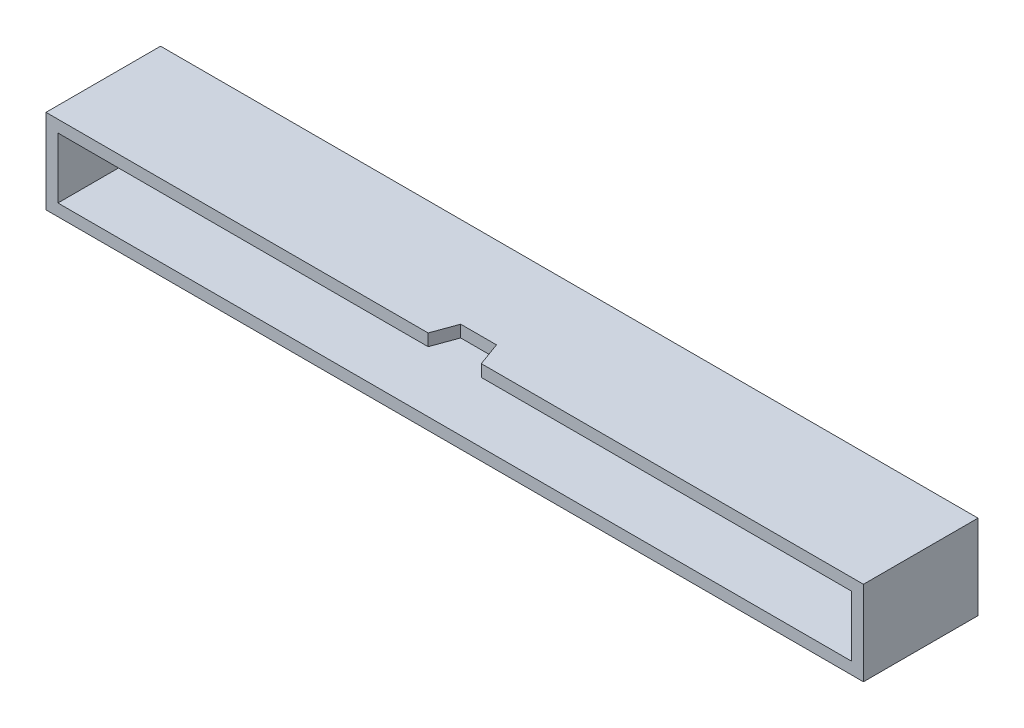
ISO-10303-21;
HEADER;
FILE_DESCRIPTION(('STEP AP214'),'2;1');
FILE_NAME('part.step','',(''),(''),'','','');
FILE_SCHEMA(('AUTOMOTIVE_DESIGN { 1 0 10303 214 1 1 1 1 }'));
ENDSEC;
DATA;
#1=APPLICATION_CONTEXT('core data for automotive mechanical design processes');
#2=APPLICATION_PROTOCOL_DEFINITION('international standard','automotive_design',2000,#1);
#3=PRODUCT_CONTEXT('',#1,'mechanical');
#4=PRODUCT('Part','Part','',(#3));
#5=PRODUCT_RELATED_PRODUCT_CATEGORY('part','',(#4));
#6=PRODUCT_DEFINITION_FORMATION('','',#4);
#7=PRODUCT_DEFINITION_CONTEXT('part definition',#1,'design');
#8=PRODUCT_DEFINITION('design','',#6,#7);
#9=PRODUCT_DEFINITION_SHAPE('','',#8);
#10=(LENGTH_UNIT() NAMED_UNIT(*) SI_UNIT(.MILLI.,.METRE.));
#11=(NAMED_UNIT(*) PLANE_ANGLE_UNIT() SI_UNIT($,.RADIAN.));
#12=(NAMED_UNIT(*) SI_UNIT($,.STERADIAN.) SOLID_ANGLE_UNIT());
#13=UNCERTAINTY_MEASURE_WITH_UNIT(LENGTH_MEASURE(1.E-05),#10,'distance_accuracy_value','');
#14=(GEOMETRIC_REPRESENTATION_CONTEXT(3) GLOBAL_UNCERTAINTY_ASSIGNED_CONTEXT((#13)) GLOBAL_UNIT_ASSIGNED_CONTEXT((#10,
#11,#12)) REPRESENTATION_CONTEXT('',''));
#15=CARTESIAN_POINT('',(0.,0.,0.));
#16=DIRECTION('',(0.,0.,1.));
#17=DIRECTION('',(1.,0.,0.));
#18=AXIS2_PLACEMENT_3D('',#15,#16,#17);
#19=CARTESIAN_POINT('',(33.48,3.54,7.60000000000002));
#20=DIRECTION('',(0.939692620785973,0.,-0.34202014332549));
#21=DIRECTION('',(-0.34202014332549,0.,-0.939692620785973));
#22=AXIS2_PLACEMENT_3D('',#19,#20,#21);
#23=PLANE('',#22);
#24=DIRECTION('',(0.,1.,0.));
#25=VECTOR('',#24,1.);
#26=CARTESIAN_POINT('',(34.207940468532,3.54,9.60000000000001));
#27=LINE('',#26,#25);
#28=CARTESIAN_POINT('',(34.207940468532,3.54,9.6));
#29=VERTEX_POINT('',#28);
#30=CARTESIAN_POINT('',(34.207940468532,2.53999998509884,9.60000000000001));
#31=VERTEX_POINT('',#30);
#32=EDGE_CURVE('E20',#29,#31,#27,.F.);
#33=ORIENTED_EDGE('',*,*,#32,.F.);
#34=DIRECTION('',(0.342020143325507,0.,0.939692620785967));
#35=VECTOR('',#34,1.);
#36=CARTESIAN_POINT('',(33.48,3.54,7.60000000000002));
#37=LINE('',#36,#35);
#38=CARTESIAN_POINT('',(33.48,3.54,7.60000000000002));
#39=VERTEX_POINT('',#38);
#40=EDGE_CURVE('E114',#39,#29,#37,.T.);
#41=ORIENTED_EDGE('',*,*,#40,.F.);
#42=DIRECTION('',(0.,1.,0.));
#43=VECTOR('',#42,1.);
#44=CARTESIAN_POINT('',(33.48,3.54,7.60000000000001));
#45=LINE('',#44,#43);
#46=CARTESIAN_POINT('',(33.48,2.53999998509884,7.60000000000002));
#47=VERTEX_POINT('',#46);
#48=EDGE_CURVE('E109',#39,#47,#45,.F.);
#49=ORIENTED_EDGE('',*,*,#48,.T.);
#50=DIRECTION('',(-0.342020143325507,0.,-0.939692620785967));
#51=VECTOR('',#50,1.);
#52=CARTESIAN_POINT('',(34.207940468532,2.53999998509884,9.6));
#53=LINE('',#52,#51);
#54=EDGE_CURVE('E111',#31,#47,#53,.T.);
#55=ORIENTED_EDGE('',*,*,#54,.F.);
#56=EDGE_LOOP('',(#33,#41,#49,#55));
#57=FACE_BOUND('',#56,.T.);
#58=ADVANCED_FACE('F17',(#57),#23,.F.);
#59=CARTESIAN_POINT('',(29.7520595314676,3.54,9.6));
#60=DIRECTION('',(-0.939692620785908,0.,-0.342020143325669));
#61=DIRECTION('',(-0.342020143325669,0.,0.939692620785908));
#62=AXIS2_PLACEMENT_3D('',#59,#60,#61);
#63=PLANE('',#62);
#64=DIRECTION('',(0.,1.,0.));
#65=VECTOR('',#64,1.);
#66=CARTESIAN_POINT('',(30.48,3.54,7.60000000000001));
#67=LINE('',#66,#65);
#68=CARTESIAN_POINT('',(30.48,2.53999998509884,7.60000000000001));
#69=VERTEX_POINT('',#68);
#70=CARTESIAN_POINT('',(30.48,3.54,7.60000000000001));
#71=VERTEX_POINT('',#70);
#72=EDGE_CURVE('E103',#69,#71,#67,.T.);
#73=ORIENTED_EDGE('',*,*,#72,.T.);
#74=DIRECTION('',(0.342020143325667,0.,-0.939692620785909));
#75=VECTOR('',#74,1.);
#76=CARTESIAN_POINT('',(29.7520595314676,3.54,9.6));
#77=LINE('',#76,#75);
#78=CARTESIAN_POINT('',(29.7520595314676,3.54,9.6));
#79=VERTEX_POINT('',#78);
#80=EDGE_CURVE('E150',#79,#71,#77,.T.);
#81=ORIENTED_EDGE('',*,*,#80,.F.);
#82=DIRECTION('',(0.,1.,0.));
#83=VECTOR('',#82,1.);
#84=CARTESIAN_POINT('',(29.7520595314676,3.54,9.6));
#85=LINE('',#84,#83);
#86=CARTESIAN_POINT('',(29.7520595314676,2.53999998509884,9.6));
#87=VERTEX_POINT('',#86);
#88=EDGE_CURVE('E136',#87,#79,#85,.T.);
#89=ORIENTED_EDGE('',*,*,#88,.F.);
#90=DIRECTION('',(-0.342020143325666,0.,0.93969262078591));
#91=VECTOR('',#90,1.);
#92=CARTESIAN_POINT('',(30.48,2.53999998509884,7.60000000000001));
#93=LINE('',#92,#91);
#94=EDGE_CURVE('E123',#69,#87,#93,.T.);
#95=ORIENTED_EDGE('',*,*,#94,.F.);
#96=EDGE_LOOP('',(#73,#81,#89,#95));
#97=FACE_BOUND('',#96,.T.);
#98=ADVANCED_FACE('F253',(#97),#63,.F.);
#99=CARTESIAN_POINT('',(30.48,3.54,7.60000000000001));
#100=DIRECTION('',(0.,0.,-1.));
#101=DIRECTION('',(-1.,0.,0.));
#102=AXIS2_PLACEMENT_3D('',#99,#100,#101);
#103=PLANE('',#102);
#104=ORIENTED_EDGE('',*,*,#48,.F.);
#105=DIRECTION('',(1.,0.,0.));
#106=VECTOR('',#105,1.);
#107=CARTESIAN_POINT('',(66.23,3.54,7.60000000000001));
#108=LINE('',#107,#106);
#109=EDGE_CURVE('E149',#71,#39,#108,.T.);
#110=ORIENTED_EDGE('',*,*,#109,.F.);
#111=ORIENTED_EDGE('',*,*,#72,.F.);
#112=DIRECTION('',(1.,0.,0.));
#113=VECTOR('',#112,1.);
#114=CARTESIAN_POINT('',(-1.26999998509884,2.53999998509884,7.60000000000002));
#115=LINE('',#114,#113);
#116=EDGE_CURVE('E119',#47,#69,#115,.F.);
#117=ORIENTED_EDGE('',*,*,#116,.F.);
#118=EDGE_LOOP('',(#104,#110,#111,#117));
#119=FACE_BOUND('',#118,.T.);
#120=ADVANCED_FACE('F120',(#119),#103,.F.);
#121=CARTESIAN_POINT('',(65.2299999850988,2.53999998509884,0.));
#122=DIRECTION('',(-1.,0.,0.));
#123=DIRECTION('',(0.,0.,1.));
#124=AXIS2_PLACEMENT_3D('',#121,#122,#123);
#125=PLANE('',#124);
#126=DIRECTION('',(0.,1.,0.));
#127=VECTOR('',#126,1.);
#128=CARTESIAN_POINT('',(65.2299999850988,0.,9.6));
#129=LINE('',#128,#127);
#130=CARTESIAN_POINT('',(65.2299999850988,2.53999998509884,9.6));
#131=VERTEX_POINT('',#130);
#132=CARTESIAN_POINT('',(65.2299999850988,-2.53999998509884,9.6));
#133=VERTEX_POINT('',#132);
#134=EDGE_CURVE('E175',#131,#133,#129,.F.);
#135=ORIENTED_EDGE('',*,*,#134,.F.);
#136=DIRECTION('',(0.,0.,-1.));
#137=VECTOR('',#136,1.);
#138=CARTESIAN_POINT('',(65.2299999850988,2.53999998509884,0.));
#139=LINE('',#138,#137);
#140=CARTESIAN_POINT('',(65.2299999850988,2.53999998509884,0.));
#141=VERTEX_POINT('',#140);
#142=EDGE_CURVE('E151',#141,#131,#139,.F.);
#143=ORIENTED_EDGE('',*,*,#142,.F.);
#144=DIRECTION('',(0.,1.,0.));
#145=VECTOR('',#144,1.);
#146=CARTESIAN_POINT('',(65.2299999850988,0.,0.));
#147=LINE('',#146,#145);
#148=CARTESIAN_POINT('',(65.2299999850988,-2.53999998509884,0.));
#149=VERTEX_POINT('',#148);
#150=EDGE_CURVE('E190',#141,#149,#147,.F.);
#151=ORIENTED_EDGE('',*,*,#150,.T.);
#152=DIRECTION('',(0.,0.,1.));
#153=VECTOR('',#152,1.);
#154=CARTESIAN_POINT('',(65.2299999850988,-2.53999998509884,0.));
#155=LINE('',#154,#153);
#156=EDGE_CURVE('E116',#133,#149,#155,.F.);
#157=ORIENTED_EDGE('',*,*,#156,.F.);
#158=EDGE_LOOP('',(#135,#143,#151,#157));
#159=FACE_BOUND('',#158,.T.);
#160=ADVANCED_FACE('F247',(#159),#125,.T.);
#161=CARTESIAN_POINT('',(65.2299999850988,-2.53999998509884,0.));
#162=DIRECTION('',(0.,1.,0.));
#163=DIRECTION('',(0.,0.,1.));
#164=AXIS2_PLACEMENT_3D('',#161,#162,#163);
#165=PLANE('',#164);
#166=DIRECTION('',(1.,0.,0.));
#167=VECTOR('',#166,1.);
#168=CARTESIAN_POINT('',(31.98,-2.53999998509884,9.6));
#169=LINE('',#168,#167);
#170=CARTESIAN_POINT('',(-1.26999998509884,-2.53999998509884,9.6));
#171=VERTEX_POINT('',#170);
#172=EDGE_CURVE('E170',#133,#171,#169,.F.);
#173=ORIENTED_EDGE('',*,*,#172,.F.);
#174=ORIENTED_EDGE('',*,*,#156,.T.);
#175=DIRECTION('',(1.,0.,0.));
#176=VECTOR('',#175,1.);
#177=CARTESIAN_POINT('',(31.98,-2.53999998509884,0.));
#178=LINE('',#177,#176);
#179=CARTESIAN_POINT('',(-1.26999998509884,-2.53999998509884,0.));
#180=VERTEX_POINT('',#179);
#181=EDGE_CURVE('E188',#149,#180,#178,.F.);
#182=ORIENTED_EDGE('',*,*,#181,.T.);
#183=DIRECTION('',(0.,0.,1.));
#184=VECTOR('',#183,1.);
#185=CARTESIAN_POINT('',(-1.26999998509884,-2.53999998509884,0.));
#186=LINE('',#185,#184);
#187=EDGE_CURVE('E128',#171,#180,#186,.F.);
#188=ORIENTED_EDGE('',*,*,#187,.F.);
#189=EDGE_LOOP('',(#173,#174,#182,#188));
#190=FACE_BOUND('',#189,.T.);
#191=ADVANCED_FACE('F243',(#190),#165,.T.);
#192=CARTESIAN_POINT('',(-1.26999998509884,-2.53999998509884,0.));
#193=DIRECTION('',(1.,0.,0.));
#194=DIRECTION('',(0.,1.,0.));
#195=AXIS2_PLACEMENT_3D('',#192,#193,#194);
#196=PLANE('',#195);
#197=DIRECTION('',(0.,1.,0.));
#198=VECTOR('',#197,1.);
#199=CARTESIAN_POINT('',(-1.26999998509884,0.,9.6));
#200=LINE('',#199,#198);
#201=CARTESIAN_POINT('',(-1.26999998509884,2.53999998509884,9.6));
#202=VERTEX_POINT('',#201);
#203=EDGE_CURVE('E165',#171,#202,#200,.T.);
#204=ORIENTED_EDGE('',*,*,#203,.F.);
#205=ORIENTED_EDGE('',*,*,#187,.T.);
#206=DIRECTION('',(0.,1.,0.));
#207=VECTOR('',#206,1.);
#208=CARTESIAN_POINT('',(-1.26999998509884,0.,0.));
#209=LINE('',#208,#207);
#210=CARTESIAN_POINT('',(-1.26999998509884,2.53999998509884,0.));
#211=VERTEX_POINT('',#210);
#212=EDGE_CURVE('E186',#180,#211,#209,.T.);
#213=ORIENTED_EDGE('',*,*,#212,.T.);
#214=DIRECTION('',(0.,0.,-1.));
#215=VECTOR('',#214,1.);
#216=CARTESIAN_POINT('',(-1.26999998509884,2.53999998509884,0.));
#217=LINE('',#216,#215);
#218=EDGE_CURVE('E154',#202,#211,#217,.T.);
#219=ORIENTED_EDGE('',*,*,#218,.F.);
#220=EDGE_LOOP('',(#204,#205,#213,#219));
#221=FACE_BOUND('',#220,.T.);
#222=ADVANCED_FACE('F240',(#221),#196,.T.);
#223=CARTESIAN_POINT('',(-1.26999998509884,2.53999998509884,0.));
#224=DIRECTION('',(0.,-1.,0.));
#225=DIRECTION('',(0.,0.,-1.));
#226=AXIS2_PLACEMENT_3D('',#223,#224,#225);
#227=PLANE('',#226);
#228=ORIENTED_EDGE('',*,*,#142,.T.);
#229=DIRECTION('',(1.,0.,0.));
#230=VECTOR('',#229,1.);
#231=CARTESIAN_POINT('',(31.98,2.53999998509884,9.6));
#232=LINE('',#231,#230);
#233=EDGE_CURVE('E127',#31,#131,#232,.T.);
#234=ORIENTED_EDGE('',*,*,#233,.F.);
#235=ORIENTED_EDGE('',*,*,#54,.T.);
#236=ORIENTED_EDGE('',*,*,#116,.T.);
#237=ORIENTED_EDGE('',*,*,#94,.T.);
#238=DIRECTION('',(1.,0.,0.));
#239=VECTOR('',#238,1.);
#240=CARTESIAN_POINT('',(31.98,2.53999998509884,9.6));
#241=LINE('',#240,#239);
#242=EDGE_CURVE('E160',#202,#87,#241,.T.);
#243=ORIENTED_EDGE('',*,*,#242,.F.);
#244=ORIENTED_EDGE('',*,*,#218,.T.);
#245=DIRECTION('',(1.,0.,0.));
#246=VECTOR('',#245,1.);
#247=CARTESIAN_POINT('',(31.98,2.53999998509884,0.));
#248=LINE('',#247,#246);
#249=EDGE_CURVE('E183',#211,#141,#248,.T.);
#250=ORIENTED_EDGE('',*,*,#249,.T.);
#251=EDGE_LOOP('',(#228,#234,#235,#236,#237,#243,#244,#250));
#252=FACE_BOUND('',#251,.T.);
#253=ADVANCED_FACE('F125',(#252),#227,.T.);
#254=CARTESIAN_POINT('',(66.23,3.54,0.));
#255=DIRECTION('',(0.,1.,0.));
#256=DIRECTION('',(0.,0.,1.));
#257=AXIS2_PLACEMENT_3D('',#254,#255,#256);
#258=PLANE('',#257);
#259=ORIENTED_EDGE('',*,*,#80,.T.);
#260=ORIENTED_EDGE('',*,*,#109,.T.);
#261=ORIENTED_EDGE('',*,*,#40,.T.);
#262=DIRECTION('',(1.,0.,0.));
#263=VECTOR('',#262,1.);
#264=CARTESIAN_POINT('',(31.98,3.54,9.6));
#265=LINE('',#264,#263);
#266=CARTESIAN_POINT('',(66.23,3.54,9.6));
#267=VERTEX_POINT('',#266);
#268=EDGE_CURVE('E144',#267,#29,#265,.F.);
#269=ORIENTED_EDGE('',*,*,#268,.F.);
#270=DIRECTION('',(0.,0.,-1.));
#271=VECTOR('',#270,1.);
#272=CARTESIAN_POINT('',(66.23,3.54,0.));
#273=LINE('',#272,#271);
#274=CARTESIAN_POINT('',(66.23,3.54,0.));
#275=VERTEX_POINT('',#274);
#276=EDGE_CURVE('E178',#275,#267,#273,.F.);
#277=ORIENTED_EDGE('',*,*,#276,.F.);
#278=DIRECTION('',(1.,0.,0.));
#279=VECTOR('',#278,1.);
#280=CARTESIAN_POINT('',(31.98,3.54,0.));
#281=LINE('',#280,#279);
#282=CARTESIAN_POINT('',(-2.27,3.54,0.));
#283=VERTEX_POINT('',#282);
#284=EDGE_CURVE('E192',#275,#283,#281,.F.);
#285=ORIENTED_EDGE('',*,*,#284,.T.);
#286=DIRECTION('',(0.,0.,1.));
#287=VECTOR('',#286,1.);
#288=CARTESIAN_POINT('',(-2.27,3.54,0.));
#289=LINE('',#288,#287);
#290=CARTESIAN_POINT('',(-2.27,3.54,9.6));
#291=VERTEX_POINT('',#290);
#292=EDGE_CURVE('E197',#291,#283,#289,.F.);
#293=ORIENTED_EDGE('',*,*,#292,.F.);
#294=DIRECTION('',(1.,0.,0.));
#295=VECTOR('',#294,1.);
#296=CARTESIAN_POINT('',(31.98,3.54,9.6));
#297=LINE('',#296,#295);
#298=EDGE_CURVE('E166',#79,#291,#297,.F.);
#299=ORIENTED_EDGE('',*,*,#298,.F.);
#300=EDGE_LOOP('',(#259,#260,#261,#269,#277,#285,#293,#299));
#301=FACE_BOUND('',#300,.T.);
#302=ADVANCED_FACE('F147',(#301),#258,.T.);
#303=CARTESIAN_POINT('',(31.98,0.,0.));
#304=DIRECTION('',(0.,0.,1.));
#305=DIRECTION('',(1.,0.,0.));
#306=AXIS2_PLACEMENT_3D('',#303,#304,#305);
#307=PLANE('',#306);
#308=ORIENTED_EDGE('',*,*,#212,.F.);
#309=ORIENTED_EDGE('',*,*,#181,.F.);
#310=ORIENTED_EDGE('',*,*,#150,.F.);
#311=ORIENTED_EDGE('',*,*,#249,.F.);
#312=EDGE_LOOP('',(#308,#309,#310,#311));
#313=FACE_BOUND('',#312,.T.);
#314=DIRECTION('',(0.,1.,0.));
#315=VECTOR('',#314,1.);
#316=CARTESIAN_POINT('',(-2.27,3.54,0.));
#317=LINE('',#316,#315);
#318=CARTESIAN_POINT('',(-2.27,-3.54,0.));
#319=VERTEX_POINT('',#318);
#320=EDGE_CURVE('E200',#283,#319,#317,.F.);
#321=ORIENTED_EDGE('',*,*,#320,.F.);
#322=ORIENTED_EDGE('',*,*,#284,.F.);
#323=DIRECTION('',(0.,1.,0.));
#324=VECTOR('',#323,1.);
#325=CARTESIAN_POINT('',(66.23,-3.54,0.));
#326=LINE('',#325,#324);
#327=CARTESIAN_POINT('',(66.23,-3.54,0.));
#328=VERTEX_POINT('',#327);
#329=EDGE_CURVE('E180',#328,#275,#326,.T.);
#330=ORIENTED_EDGE('',*,*,#329,.F.);
#331=DIRECTION('',(1.,0.,0.));
#332=VECTOR('',#331,1.);
#333=CARTESIAN_POINT('',(-2.27,-3.54,0.));
#334=LINE('',#333,#332);
#335=EDGE_CURVE('E203',#319,#328,#334,.T.);
#336=ORIENTED_EDGE('',*,*,#335,.F.);
#337=EDGE_LOOP('',(#321,#322,#330,#336));
#338=FACE_BOUND('',#337,.T.);
#339=ADVANCED_FACE('F201',(#313,#338),#307,.F.);
#340=CARTESIAN_POINT('',(66.23,-3.54,0.));
#341=DIRECTION('',(1.,0.,0.));
#342=DIRECTION('',(0.,0.,-1.));
#343=AXIS2_PLACEMENT_3D('',#340,#341,#342);
#344=PLANE('',#343);
#345=DIRECTION('',(0.,1.,0.));
#346=VECTOR('',#345,1.);
#347=CARTESIAN_POINT('',(66.23,0.,9.6));
#348=LINE('',#347,#346);
#349=CARTESIAN_POINT('',(66.23,-3.54,9.6));
#350=VERTEX_POINT('',#349);
#351=EDGE_CURVE('E168',#350,#267,#348,.T.);
#352=ORIENTED_EDGE('',*,*,#351,.F.);
#353=DIRECTION('',(0.,0.,-1.));
#354=VECTOR('',#353,1.);
#355=CARTESIAN_POINT('',(66.23,-3.54,0.));
#356=LINE('',#355,#354);
#357=EDGE_CURVE('E208',#328,#350,#356,.F.);
#358=ORIENTED_EDGE('',*,*,#357,.F.);
#359=ORIENTED_EDGE('',*,*,#329,.T.);
#360=ORIENTED_EDGE('',*,*,#276,.T.);
#361=EDGE_LOOP('',(#352,#358,#359,#360));
#362=FACE_BOUND('',#361,.T.);
#363=ADVANCED_FACE('F217',(#362),#344,.T.);
#364=CARTESIAN_POINT('',(31.98,0.,9.6));
#365=DIRECTION('',(0.,0.,1.));
#366=DIRECTION('',(1.,0.,0.));
#367=AXIS2_PLACEMENT_3D('',#364,#365,#366);
#368=PLANE('',#367);
#369=ORIENTED_EDGE('',*,*,#351,.T.);
#370=ORIENTED_EDGE('',*,*,#268,.T.);
#371=ORIENTED_EDGE('',*,*,#32,.T.);
#372=ORIENTED_EDGE('',*,*,#233,.T.);
#373=ORIENTED_EDGE('',*,*,#134,.T.);
#374=ORIENTED_EDGE('',*,*,#172,.T.);
#375=ORIENTED_EDGE('',*,*,#203,.T.);
#376=ORIENTED_EDGE('',*,*,#242,.T.);
#377=ORIENTED_EDGE('',*,*,#88,.T.);
#378=ORIENTED_EDGE('',*,*,#298,.T.);
#379=DIRECTION('',(0.,1.,0.));
#380=VECTOR('',#379,1.);
#381=CARTESIAN_POINT('',(-2.27,3.54,9.6));
#382=LINE('',#381,#380);
#383=CARTESIAN_POINT('',(-2.27,-3.54,9.6));
#384=VERTEX_POINT('',#383);
#385=EDGE_CURVE('E35',#384,#291,#382,.T.);
#386=ORIENTED_EDGE('',*,*,#385,.F.);
#387=DIRECTION('',(1.,0.,0.));
#388=VECTOR('',#387,1.);
#389=CARTESIAN_POINT('',(-2.27,-3.54,9.6));
#390=LINE('',#389,#388);
#391=EDGE_CURVE('E26',#350,#384,#390,.F.);
#392=ORIENTED_EDGE('',*,*,#391,.F.);
#393=EDGE_LOOP('',(#369,#370,#371,#372,#373,#374,#375,#376,#377,#378,#386,#392));
#394=FACE_BOUND('',#393,.T.);
#395=ADVANCED_FACE('F141',(#394),#368,.T.);
#396=CARTESIAN_POINT('',(-2.27,3.54,0.));
#397=DIRECTION('',(-1.,0.,0.));
#398=DIRECTION('',(0.,0.,1.));
#399=AXIS2_PLACEMENT_3D('',#396,#397,#398);
#400=PLANE('',#399);
#401=ORIENTED_EDGE('',*,*,#385,.T.);
#402=ORIENTED_EDGE('',*,*,#292,.T.);
#403=ORIENTED_EDGE('',*,*,#320,.T.);
#404=DIRECTION('',(0.,0.,-1.));
#405=VECTOR('',#404,1.);
#406=CARTESIAN_POINT('',(-2.27,-3.54,0.));
#407=LINE('',#406,#405);
#408=EDGE_CURVE('E11',#384,#319,#407,.T.);
#409=ORIENTED_EDGE('',*,*,#408,.F.);
#410=EDGE_LOOP('',(#401,#402,#403,#409));
#411=FACE_BOUND('',#410,.T.);
#412=ADVANCED_FACE('F206',(#411),#400,.T.);
#413=CARTESIAN_POINT('',(-2.27,-3.54,0.));
#414=DIRECTION('',(0.,-1.,0.));
#415=DIRECTION('',(0.,0.,-1.));
#416=AXIS2_PLACEMENT_3D('',#413,#414,#415);
#417=PLANE('',#416);
#418=ORIENTED_EDGE('',*,*,#391,.T.);
#419=ORIENTED_EDGE('',*,*,#408,.T.);
#420=ORIENTED_EDGE('',*,*,#335,.T.);
#421=ORIENTED_EDGE('',*,*,#357,.T.);
#422=EDGE_LOOP('',(#418,#419,#420,#421));
#423=FACE_BOUND('',#422,.T.);
#424=ADVANCED_FACE('F219',(#423),#417,.T.);
#425=CLOSED_SHELL('',(#58,#98,#120,#160,#191,#222,#253,#302,#339,#363,#395,#412,#424));
#426=MANIFOLD_SOLID_BREP('B1',#425);
#427=ADVANCED_BREP_SHAPE_REPRESENTATION('',(#18,#426),#14);
#428=SHAPE_DEFINITION_REPRESENTATION(#9,#427);
ENDSEC;
END-ISO-10303-21;
